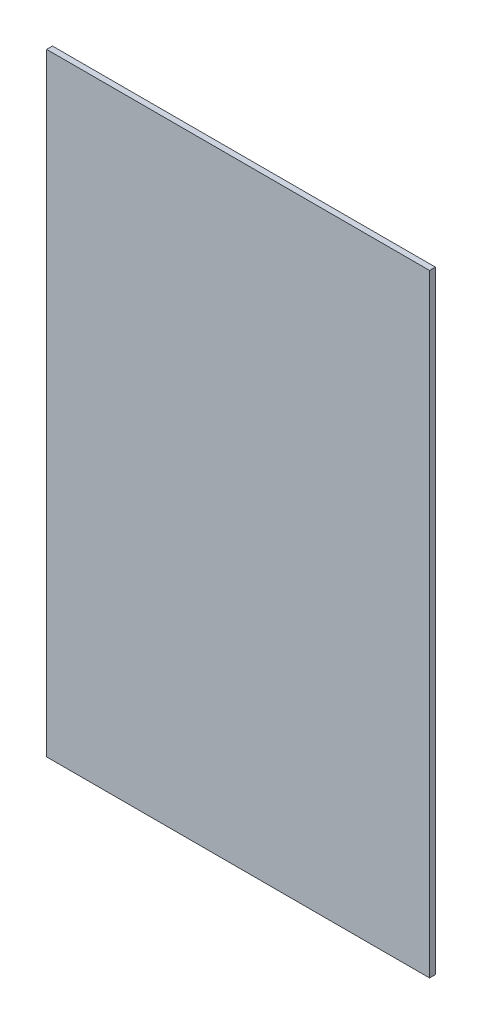
ISO-10303-21;
HEADER;
FILE_DESCRIPTION(('STEP AP214'),'2;1');
FILE_NAME('part.step','',(''),(''),'','','');
FILE_SCHEMA(('AUTOMOTIVE_DESIGN { 1 0 10303 214 1 1 1 1 }'));
ENDSEC;
DATA;
#1=APPLICATION_CONTEXT('core data for automotive mechanical design processes');
#2=APPLICATION_PROTOCOL_DEFINITION('international standard','automotive_design',2000,#1);
#3=PRODUCT_CONTEXT('',#1,'mechanical');
#4=PRODUCT('Part','Part','',(#3));
#5=PRODUCT_RELATED_PRODUCT_CATEGORY('part','',(#4));
#6=PRODUCT_DEFINITION_FORMATION('','',#4);
#7=PRODUCT_DEFINITION_CONTEXT('part definition',#1,'design');
#8=PRODUCT_DEFINITION('design','',#6,#7);
#9=PRODUCT_DEFINITION_SHAPE('','',#8);
#10=(LENGTH_UNIT() NAMED_UNIT(*) SI_UNIT(.MILLI.,.METRE.));
#11=(NAMED_UNIT(*) PLANE_ANGLE_UNIT() SI_UNIT($,.RADIAN.));
#12=(NAMED_UNIT(*) SI_UNIT($,.STERADIAN.) SOLID_ANGLE_UNIT());
#13=UNCERTAINTY_MEASURE_WITH_UNIT(LENGTH_MEASURE(1.E-05),#10,'distance_accuracy_value','');
#14=(GEOMETRIC_REPRESENTATION_CONTEXT(3) GLOBAL_UNCERTAINTY_ASSIGNED_CONTEXT((#13)) GLOBAL_UNIT_ASSIGNED_CONTEXT((#10,
#11,#12)) REPRESENTATION_CONTEXT('',''));
#15=CARTESIAN_POINT('',(0.,0.,0.));
#16=DIRECTION('',(0.,0.,1.));
#17=DIRECTION('',(1.,0.,0.));
#18=AXIS2_PLACEMENT_3D('',#15,#16,#17);
#19=CARTESIAN_POINT('',(0.,0.,0.76));
#20=DIRECTION('',(0.,1.,0.));
#21=DIRECTION('',(0.,0.,1.));
#22=AXIS2_PLACEMENT_3D('',#19,#20,#21);
#23=PLANE('',#22);
#24=DIRECTION('',(1.,0.,0.));
#25=VECTOR('',#24,1.);
#26=CARTESIAN_POINT('',(0.,0.,0.));
#27=LINE('',#26,#25);
#28=CARTESIAN_POINT('',(0.,0.,0.));
#29=VERTEX_POINT('',#28);
#30=CARTESIAN_POINT('',(50.,0.,0.));
#31=VERTEX_POINT('',#30);
#32=EDGE_CURVE('E95',#29,#31,#27,.T.);
#33=ORIENTED_EDGE('',*,*,#32,.T.);
#34=DIRECTION('',(0.,0.,-1.));
#35=VECTOR('',#34,1.);
#36=CARTESIAN_POINT('',(50.,0.,0.76));
#37=LINE('',#36,#35);
#38=CARTESIAN_POINT('',(50.,0.,0.76));
#39=VERTEX_POINT('',#38);
#40=EDGE_CURVE('E11',#39,#31,#37,.T.);
#41=ORIENTED_EDGE('',*,*,#40,.F.);
#42=DIRECTION('',(1.,0.,0.));
#43=VECTOR('',#42,1.);
#44=CARTESIAN_POINT('',(0.,0.,0.76));
#45=LINE('',#44,#43);
#46=CARTESIAN_POINT('',(0.,0.,0.76));
#47=VERTEX_POINT('',#46);
#48=EDGE_CURVE('E81',#47,#39,#45,.T.);
#49=ORIENTED_EDGE('',*,*,#48,.F.);
#50=DIRECTION('',(0.,0.,-1.));
#51=VECTOR('',#50,1.);
#52=CARTESIAN_POINT('',(0.,0.,0.76));
#53=LINE('',#52,#51);
#54=EDGE_CURVE('E48',#47,#29,#53,.T.);
#55=ORIENTED_EDGE('',*,*,#54,.T.);
#56=EDGE_LOOP('',(#33,#41,#49,#55));
#57=FACE_BOUND('',#56,.T.);
#58=ADVANCED_FACE('F32',(#57),#23,.F.);
#59=CARTESIAN_POINT('',(50.,0.,0.76));
#60=DIRECTION('',(-1.,0.,0.));
#61=DIRECTION('',(0.,0.,1.));
#62=AXIS2_PLACEMENT_3D('',#59,#60,#61);
#63=PLANE('',#62);
#64=DIRECTION('',(0.,1.,0.));
#65=VECTOR('',#64,1.);
#66=CARTESIAN_POINT('',(50.,0.,0.));
#67=LINE('',#66,#65);
#68=CARTESIAN_POINT('',(50.,80.,0.));
#69=VERTEX_POINT('',#68);
#70=EDGE_CURVE('E86',#31,#69,#67,.T.);
#71=ORIENTED_EDGE('',*,*,#70,.T.);
#72=DIRECTION('',(0.,0.,-1.));
#73=VECTOR('',#72,1.);
#74=CARTESIAN_POINT('',(50.,80.,0.76));
#75=LINE('',#74,#73);
#76=CARTESIAN_POINT('',(50.,80.,0.76));
#77=VERTEX_POINT('',#76);
#78=EDGE_CURVE('E40',#77,#69,#75,.T.);
#79=ORIENTED_EDGE('',*,*,#78,.F.);
#80=DIRECTION('',(0.,1.,0.));
#81=VECTOR('',#80,1.);
#82=CARTESIAN_POINT('',(50.,0.,0.76));
#83=LINE('',#82,#81);
#84=EDGE_CURVE('E73',#39,#77,#83,.T.);
#85=ORIENTED_EDGE('',*,*,#84,.F.);
#86=ORIENTED_EDGE('',*,*,#40,.T.);
#87=EDGE_LOOP('',(#71,#79,#85,#86));
#88=FACE_BOUND('',#87,.T.);
#89=ADVANCED_FACE('F85',(#88),#63,.F.);
#90=CARTESIAN_POINT('',(0.,80.,0.76));
#91=DIRECTION('',(0.,1.,0.));
#92=DIRECTION('',(0.,0.,1.));
#93=AXIS2_PLACEMENT_3D('',#90,#91,#92);
#94=PLANE('',#93);
#95=DIRECTION('',(1.,0.,0.));
#96=VECTOR('',#95,1.);
#97=CARTESIAN_POINT('',(0.,80.,0.));
#98=LINE('',#97,#96);
#99=CARTESIAN_POINT('',(0.,80.,0.));
#100=VERTEX_POINT('',#99);
#101=EDGE_CURVE('E98',#100,#69,#98,.T.);
#102=ORIENTED_EDGE('',*,*,#101,.F.);
#103=DIRECTION('',(0.,0.,-1.));
#104=VECTOR('',#103,1.);
#105=CARTESIAN_POINT('',(0.,80.,0.76));
#106=LINE('',#105,#104);
#107=CARTESIAN_POINT('',(0.,80.,0.76));
#108=VERTEX_POINT('',#107);
#109=EDGE_CURVE('E62',#108,#100,#106,.T.);
#110=ORIENTED_EDGE('',*,*,#109,.F.);
#111=DIRECTION('',(1.,0.,0.));
#112=VECTOR('',#111,1.);
#113=CARTESIAN_POINT('',(0.,80.,0.76));
#114=LINE('',#113,#112);
#115=EDGE_CURVE('E80',#108,#77,#114,.T.);
#116=ORIENTED_EDGE('',*,*,#115,.T.);
#117=ORIENTED_EDGE('',*,*,#78,.T.);
#118=EDGE_LOOP('',(#102,#110,#116,#117));
#119=FACE_BOUND('',#118,.T.);
#120=ADVANCED_FACE('F89',(#119),#94,.T.);
#121=CARTESIAN_POINT('',(0.,0.,0.76));
#122=DIRECTION('',(-1.,0.,0.));
#123=DIRECTION('',(0.,0.,1.));
#124=AXIS2_PLACEMENT_3D('',#121,#122,#123);
#125=PLANE('',#124);
#126=DIRECTION('',(0.,1.,0.));
#127=VECTOR('',#126,1.);
#128=CARTESIAN_POINT('',(0.,0.,0.));
#129=LINE('',#128,#127);
#130=EDGE_CURVE('E100',#29,#100,#129,.T.);
#131=ORIENTED_EDGE('',*,*,#130,.F.);
#132=ORIENTED_EDGE('',*,*,#54,.F.);
#133=DIRECTION('',(0.,1.,0.));
#134=VECTOR('',#133,1.);
#135=CARTESIAN_POINT('',(0.,0.,0.76));
#136=LINE('',#135,#134);
#137=EDGE_CURVE('E90',#47,#108,#136,.T.);
#138=ORIENTED_EDGE('',*,*,#137,.T.);
#139=ORIENTED_EDGE('',*,*,#109,.T.);
#140=EDGE_LOOP('',(#131,#132,#138,#139));
#141=FACE_BOUND('',#140,.T.);
#142=ADVANCED_FACE('F106',(#141),#125,.T.);
#143=CARTESIAN_POINT('',(0.,0.,0.76));
#144=DIRECTION('',(0.,0.,1.));
#145=DIRECTION('',(1.,0.,0.));
#146=AXIS2_PLACEMENT_3D('',#143,#144,#145);
#147=PLANE('',#146);
#148=ORIENTED_EDGE('',*,*,#48,.T.);
#149=ORIENTED_EDGE('',*,*,#84,.T.);
#150=ORIENTED_EDGE('',*,*,#115,.F.);
#151=ORIENTED_EDGE('',*,*,#137,.F.);
#152=EDGE_LOOP('',(#148,#149,#150,#151));
#153=FACE_BOUND('',#152,.T.);
#154=ADVANCED_FACE('F77',(#153),#147,.T.);
#155=CARTESIAN_POINT('',(0.,0.,0.));
#156=DIRECTION('',(0.,0.,1.));
#157=DIRECTION('',(1.,0.,0.));
#158=AXIS2_PLACEMENT_3D('',#155,#156,#157);
#159=PLANE('',#158);
#160=ORIENTED_EDGE('',*,*,#32,.F.);
#161=ORIENTED_EDGE('',*,*,#130,.T.);
#162=ORIENTED_EDGE('',*,*,#101,.T.);
#163=ORIENTED_EDGE('',*,*,#70,.F.);
#164=EDGE_LOOP('',(#160,#161,#162,#163));
#165=FACE_BOUND('',#164,.T.);
#166=ADVANCED_FACE('F105',(#165),#159,.F.);
#167=CLOSED_SHELL('',(#58,#89,#120,#142,#154,#166));
#168=MANIFOLD_SOLID_BREP('B2',#167);
#169=ADVANCED_BREP_SHAPE_REPRESENTATION('',(#18,#168),#14);
#170=SHAPE_DEFINITION_REPRESENTATION(#9,#169);
ENDSEC;
END-ISO-10303-21;
